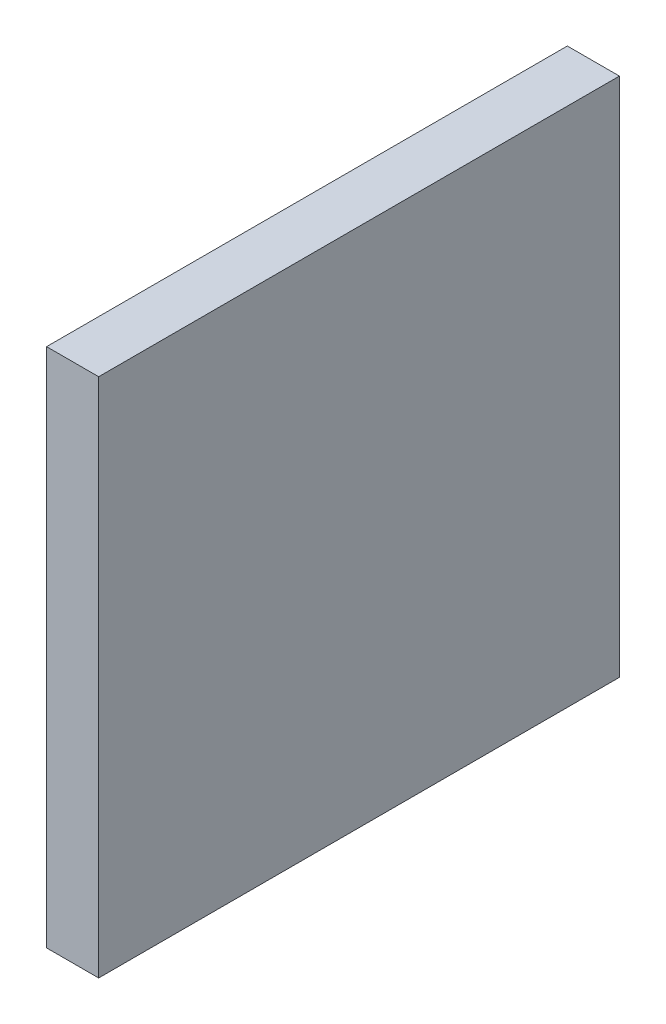
ISO-10303-21;
HEADER;
FILE_DESCRIPTION(('STEP AP214'),'2;1');
FILE_NAME('part.step','',(''),(''),'','','');
FILE_SCHEMA(('AUTOMOTIVE_DESIGN { 1 0 10303 214 1 1 1 1 }'));
ENDSEC;
DATA;
#1=APPLICATION_CONTEXT('core data for automotive mechanical design processes');
#2=APPLICATION_PROTOCOL_DEFINITION('international standard','automotive_design',2000,#1);
#3=PRODUCT_CONTEXT('',#1,'mechanical');
#4=PRODUCT('Part','Part','',(#3));
#5=PRODUCT_RELATED_PRODUCT_CATEGORY('part','',(#4));
#6=PRODUCT_DEFINITION_FORMATION('','',#4);
#7=PRODUCT_DEFINITION_CONTEXT('part definition',#1,'design');
#8=PRODUCT_DEFINITION('design','',#6,#7);
#9=PRODUCT_DEFINITION_SHAPE('','',#8);
#10=(LENGTH_UNIT() NAMED_UNIT(*) SI_UNIT(.MILLI.,.METRE.));
#11=(NAMED_UNIT(*) PLANE_ANGLE_UNIT() SI_UNIT($,.RADIAN.));
#12=(NAMED_UNIT(*) SI_UNIT($,.STERADIAN.) SOLID_ANGLE_UNIT());
#13=UNCERTAINTY_MEASURE_WITH_UNIT(LENGTH_MEASURE(1.E-05),#10,'distance_accuracy_value','');
#14=(GEOMETRIC_REPRESENTATION_CONTEXT(3) GLOBAL_UNCERTAINTY_ASSIGNED_CONTEXT((#13)) GLOBAL_UNIT_ASSIGNED_CONTEXT((#10,
#11,#12)) REPRESENTATION_CONTEXT('',''));
#15=CARTESIAN_POINT('',(0.,0.,0.));
#16=DIRECTION('',(0.,0.,1.));
#17=DIRECTION('',(1.,0.,0.));
#18=AXIS2_PLACEMENT_3D('',#15,#16,#17);
#19=CARTESIAN_POINT('',(-8.,0.,0.));
#20=DIRECTION('',(-1.,0.,0.));
#21=DIRECTION('',(0.,0.,1.));
#22=AXIS2_PLACEMENT_3D('',#19,#20,#21);
#23=PLANE('',#22);
#24=DIRECTION('',(0.,1.,0.));
#25=VECTOR('',#24,1.);
#26=CARTESIAN_POINT('',(-8.,-497.839817094446,-491.311498588477));
#27=LINE('',#26,#25);
#28=CARTESIAN_POINT('',(-8.,-487.839817094446,-491.311498588477));
#29=VERTEX_POINT('',#28);
#30=CARTESIAN_POINT('',(-8.,-382.099817094446,-491.311498588477));
#31=VERTEX_POINT('',#30);
#32=EDGE_CURVE('E189',#29,#31,#27,.T.);
#33=ORIENTED_EDGE('',*,*,#32,.T.);
#34=CARTESIAN_POINT('',(-8.,-382.099817094446,-501.311498588477));
#35=DIRECTION('',(-1.,0.,0.));
#36=DIRECTION('',(0.,0.,1.));
#37=AXIS2_PLACEMENT_3D('',#34,#35,#36);
#38=CIRCLE('',#37,10.);
#39=CARTESIAN_POINT('',(-8.,-372.099817094446,-501.311498588477));
#40=VERTEX_POINT('',#39);
#41=EDGE_CURVE('E276',#31,#40,#38,.T.);
#42=ORIENTED_EDGE('',*,*,#41,.T.);
#43=DIRECTION('',(0.,0.,1.));
#44=VECTOR('',#43,1.);
#45=CARTESIAN_POINT('',(-8.,-372.099817094446,-637.051498588477));
#46=LINE('',#45,#44);
#47=CARTESIAN_POINT('',(-8.,-372.099817094446,-627.051498588477));
#48=VERTEX_POINT('',#47);
#49=EDGE_CURVE('E296',#48,#40,#46,.T.);
#50=ORIENTED_EDGE('',*,*,#49,.F.);
#51=CARTESIAN_POINT('',(-8.,-382.099817094446,-627.051498588477));
#52=DIRECTION('',(-1.,0.,0.));
#53=DIRECTION('',(0.,0.,1.));
#54=AXIS2_PLACEMENT_3D('',#51,#52,#53);
#55=CIRCLE('',#54,10.);
#56=CARTESIAN_POINT('',(-8.,-382.099817094446,-637.051498588477));
#57=VERTEX_POINT('',#56);
#58=EDGE_CURVE('E274',#48,#57,#55,.T.);
#59=ORIENTED_EDGE('',*,*,#58,.T.);
#60=DIRECTION('',(0.,1.,0.));
#61=VECTOR('',#60,1.);
#62=CARTESIAN_POINT('',(-8.,-497.839817094446,-637.051498588477));
#63=LINE('',#62,#61);
#64=CARTESIAN_POINT('',(-8.,-487.839817094446,-637.051498588477));
#65=VERTEX_POINT('',#64);
#66=EDGE_CURVE('E196',#65,#57,#63,.T.);
#67=ORIENTED_EDGE('',*,*,#66,.F.);
#68=CARTESIAN_POINT('',(-8.,-487.839817094446,-627.051498588477));
#69=DIRECTION('',(-1.,0.,0.));
#70=DIRECTION('',(0.,0.,1.));
#71=AXIS2_PLACEMENT_3D('',#68,#69,#70);
#72=CIRCLE('',#71,10.);
#73=CARTESIAN_POINT('',(-8.,-497.839817094446,-627.051498588477));
#74=VERTEX_POINT('',#73);
#75=EDGE_CURVE('E240',#65,#74,#72,.T.);
#76=ORIENTED_EDGE('',*,*,#75,.T.);
#77=DIRECTION('',(0.,0.,1.));
#78=VECTOR('',#77,1.);
#79=CARTESIAN_POINT('',(-8.,-497.839817094446,-637.051498588477));
#80=LINE('',#79,#78);
#81=CARTESIAN_POINT('',(-8.,-497.839817094446,-501.311498588477));
#82=VERTEX_POINT('',#81);
#83=EDGE_CURVE('E192',#74,#82,#80,.T.);
#84=ORIENTED_EDGE('',*,*,#83,.T.);
#85=CARTESIAN_POINT('',(-8.,-487.839817094446,-501.311498588477));
#86=DIRECTION('',(-1.,0.,0.));
#87=DIRECTION('',(0.,0.,1.));
#88=AXIS2_PLACEMENT_3D('',#85,#86,#87);
#89=CIRCLE('',#88,10.);
#90=EDGE_CURVE('E242',#82,#29,#89,.T.);
#91=ORIENTED_EDGE('',*,*,#90,.T.);
#92=EDGE_LOOP('',(#33,#42,#50,#59,#67,#76,#84,#91));
#93=FACE_BOUND('',#92,.T.);
#94=DIRECTION('',(0.,1.,0.));
#95=VECTOR('',#94,1.);
#96=CARTESIAN_POINT('',(-8.,-486.840789535951,-611.792471029982));
#97=LINE('',#96,#95);
#98=CARTESIAN_POINT('',(-8.,-486.840789535951,-611.792471029982));
#99=VERTEX_POINT('',#98);
#100=CARTESIAN_POINT('',(-8.,-387.358844652941,-611.792471029982));
#101=VERTEX_POINT('',#100);
#102=EDGE_CURVE('E158',#99,#101,#97,.T.);
#103=ORIENTED_EDGE('',*,*,#102,.T.);
#104=DIRECTION('',(0.,0.,1.));
#105=VECTOR('',#104,1.);
#106=CARTESIAN_POINT('',(-8.,-387.358844652941,-611.792471029982));
#107=LINE('',#106,#105);
#108=CARTESIAN_POINT('',(-8.,-387.358844652941,-517.310526146972));
#109=VERTEX_POINT('',#108);
#110=EDGE_CURVE('E185',#101,#109,#107,.T.);
#111=ORIENTED_EDGE('',*,*,#110,.T.);
#112=CARTESIAN_POINT('',(-8.,-392.358844652941,-517.310526146972));
#113=DIRECTION('',(-1.,0.,0.));
#114=DIRECTION('',(0.,0.,1.));
#115=AXIS2_PLACEMENT_3D('',#112,#113,#114);
#116=CIRCLE('',#115,5.);
#117=CARTESIAN_POINT('',(-8.,-392.358844652941,-512.310526146972));
#118=VERTEX_POINT('',#117);
#119=EDGE_CURVE('E268',#109,#118,#116,.F.);
#120=ORIENTED_EDGE('',*,*,#119,.T.);
#121=DIRECTION('',(0.,1.,0.));
#122=VECTOR('',#121,1.);
#123=CARTESIAN_POINT('',(-8.,-486.840789535951,-512.310526146972));
#124=LINE('',#123,#122);
#125=CARTESIAN_POINT('',(-8.,-481.840789535951,-512.310526146972));
#126=VERTEX_POINT('',#125);
#127=EDGE_CURVE('E182',#126,#118,#124,.T.);
#128=ORIENTED_EDGE('',*,*,#127,.F.);
#129=CARTESIAN_POINT('',(-8.,-481.840789535951,-517.310526146972));
#130=DIRECTION('',(-1.,0.,0.));
#131=DIRECTION('',(0.,0.,1.));
#132=AXIS2_PLACEMENT_3D('',#129,#130,#131);
#133=CIRCLE('',#132,5.);
#134=CARTESIAN_POINT('',(-8.,-486.840789535951,-517.310526146972));
#135=VERTEX_POINT('',#134);
#136=EDGE_CURVE('E181',#126,#135,#133,.F.);
#137=ORIENTED_EDGE('',*,*,#136,.T.);
#138=DIRECTION('',(0.,0.,1.));
#139=VECTOR('',#138,1.);
#140=CARTESIAN_POINT('',(-8.,-486.840789535951,-611.792471029982));
#141=LINE('',#140,#139);
#142=EDGE_CURVE('E171',#99,#135,#141,.T.);
#143=ORIENTED_EDGE('',*,*,#142,.F.);
#144=EDGE_LOOP('',(#103,#111,#120,#128,#137,#143));
#145=FACE_BOUND('',#144,.T.);
#146=ADVANCED_FACE('F38',(#93,#145),#23,.T.);
#147=CARTESIAN_POINT('',(100.,-1000.,-1.22464679914735E-13));
#148=DIRECTION('',(0.,1.,0.));
#149=DIRECTION('',(0.,0.,1.));
#150=AXIS2_PLACEMENT_3D('',#147,#148,#149);
#151=PLANE('',#150);
#152=DIRECTION('',(0.,0.,-1.));
#153=VECTOR('',#152,1.);
#154=CARTESIAN_POINT('',(0.,-1000.,-1.22464679914735E-13));
#155=LINE('',#154,#153);
#156=CARTESIAN_POINT('',(0.,-1000.,-1.22464679914735E-13));
#157=VERTEX_POINT('',#156);
#158=CARTESIAN_POINT('',(0.,-1000.,-1000.));
#159=VERTEX_POINT('',#158);
#160=EDGE_CURVE('E199',#157,#159,#155,.T.);
#161=ORIENTED_EDGE('',*,*,#160,.T.);
#162=DIRECTION('',(-1.,0.,0.));
#163=VECTOR('',#162,1.);
#164=CARTESIAN_POINT('',(100.,-1000.,-1000.));
#165=LINE('',#164,#163);
#166=CARTESIAN_POINT('',(100.,-1000.,-1000.));
#167=VERTEX_POINT('',#166);
#168=EDGE_CURVE('E235',#167,#159,#165,.T.);
#169=ORIENTED_EDGE('',*,*,#168,.F.);
#170=DIRECTION('',(0.,0.,-1.));
#171=VECTOR('',#170,1.);
#172=CARTESIAN_POINT('',(100.,-1000.,-1.22464679914735E-13));
#173=LINE('',#172,#171);
#174=CARTESIAN_POINT('',(100.,-1000.,-1.22464679914735E-13));
#175=VERTEX_POINT('',#174);
#176=EDGE_CURVE('E208',#175,#167,#173,.T.);
#177=ORIENTED_EDGE('',*,*,#176,.F.);
#178=DIRECTION('',(-1.,0.,0.));
#179=VECTOR('',#178,1.);
#180=CARTESIAN_POINT('',(100.,-1000.,-1.22464679914735E-13));
#181=LINE('',#180,#179);
#182=EDGE_CURVE('E219',#175,#157,#181,.T.);
#183=ORIENTED_EDGE('',*,*,#182,.T.);
#184=EDGE_LOOP('',(#161,#169,#177,#183));
#185=FACE_BOUND('',#184,.T.);
#186=ADVANCED_FACE('F325',(#185),#151,.F.);
#187=CARTESIAN_POINT('',(100.,0.,-1000.));
#188=DIRECTION('',(0.,0.,-1.));
#189=DIRECTION('',(0.,1.,0.));
#190=AXIS2_PLACEMENT_3D('',#187,#188,#189);
#191=PLANE('',#190);
#192=DIRECTION('',(0.,-1.,0.));
#193=VECTOR('',#192,1.);
#194=CARTESIAN_POINT('',(0.,0.,-1000.));
#195=LINE('',#194,#193);
#196=CARTESIAN_POINT('',(0.,0.,-1000.));
#197=VERTEX_POINT('',#196);
#198=EDGE_CURVE('E222',#197,#159,#195,.T.);
#199=ORIENTED_EDGE('',*,*,#198,.F.);
#200=DIRECTION('',(-1.,0.,0.));
#201=VECTOR('',#200,1.);
#202=CARTESIAN_POINT('',(100.,0.,-1000.));
#203=LINE('',#202,#201);
#204=CARTESIAN_POINT('',(100.,0.,-1000.));
#205=VERTEX_POINT('',#204);
#206=EDGE_CURVE('E233',#205,#197,#203,.T.);
#207=ORIENTED_EDGE('',*,*,#206,.F.);
#208=DIRECTION('',(0.,-1.,0.));
#209=VECTOR('',#208,1.);
#210=CARTESIAN_POINT('',(100.,0.,-1000.));
#211=LINE('',#210,#209);
#212=EDGE_CURVE('E210',#205,#167,#211,.T.);
#213=ORIENTED_EDGE('',*,*,#212,.T.);
#214=ORIENTED_EDGE('',*,*,#168,.T.);
#215=EDGE_LOOP('',(#199,#207,#213,#214));
#216=FACE_BOUND('',#215,.T.);
#217=ADVANCED_FACE('F330',(#216),#191,.T.);
#218=CARTESIAN_POINT('',(100.,0.,0.));
#219=DIRECTION('',(0.,1.,0.));
#220=DIRECTION('',(0.,0.,1.));
#221=AXIS2_PLACEMENT_3D('',#218,#219,#220);
#222=PLANE('',#221);
#223=DIRECTION('',(0.,0.,-1.));
#224=VECTOR('',#223,1.);
#225=CARTESIAN_POINT('',(0.,0.,0.));
#226=LINE('',#225,#224);
#227=CARTESIAN_POINT('',(0.,0.,0.));
#228=VERTEX_POINT('',#227);
#229=EDGE_CURVE('E225',#228,#197,#226,.T.);
#230=ORIENTED_EDGE('',*,*,#229,.F.);
#231=DIRECTION('',(-1.,0.,0.));
#232=VECTOR('',#231,1.);
#233=CARTESIAN_POINT('',(100.,0.,0.));
#234=LINE('',#233,#232);
#235=CARTESIAN_POINT('',(100.,0.,0.));
#236=VERTEX_POINT('',#235);
#237=EDGE_CURVE('E231',#236,#228,#234,.T.);
#238=ORIENTED_EDGE('',*,*,#237,.F.);
#239=DIRECTION('',(0.,0.,-1.));
#240=VECTOR('',#239,1.);
#241=CARTESIAN_POINT('',(100.,0.,0.));
#242=LINE('',#241,#240);
#243=EDGE_CURVE('E214',#236,#205,#242,.T.);
#244=ORIENTED_EDGE('',*,*,#243,.T.);
#245=ORIENTED_EDGE('',*,*,#206,.T.);
#246=EDGE_LOOP('',(#230,#238,#244,#245));
#247=FACE_BOUND('',#246,.T.);
#248=ADVANCED_FACE('F356',(#247),#222,.T.);
#249=CARTESIAN_POINT('',(100.,0.,0.));
#250=DIRECTION('',(0.,0.,-1.));
#251=DIRECTION('',(0.,1.,0.));
#252=AXIS2_PLACEMENT_3D('',#249,#250,#251);
#253=PLANE('',#252);
#254=DIRECTION('',(0.,-1.,0.));
#255=VECTOR('',#254,1.);
#256=CARTESIAN_POINT('',(0.,0.,0.));
#257=LINE('',#256,#255);
#258=EDGE_CURVE('E211',#228,#157,#257,.T.);
#259=ORIENTED_EDGE('',*,*,#258,.T.);
#260=ORIENTED_EDGE('',*,*,#182,.F.);
#261=DIRECTION('',(0.,-1.,0.));
#262=VECTOR('',#261,1.);
#263=CARTESIAN_POINT('',(100.,0.,0.));
#264=LINE('',#263,#262);
#265=EDGE_CURVE('E217',#236,#175,#264,.T.);
#266=ORIENTED_EDGE('',*,*,#265,.F.);
#267=ORIENTED_EDGE('',*,*,#237,.T.);
#268=EDGE_LOOP('',(#259,#260,#266,#267));
#269=FACE_BOUND('',#268,.T.);
#270=ADVANCED_FACE('F350',(#269),#253,.F.);
#271=CARTESIAN_POINT('',(100.,0.,0.));
#272=DIRECTION('',(-1.,0.,0.));
#273=DIRECTION('',(0.,0.,1.));
#274=AXIS2_PLACEMENT_3D('',#271,#272,#273);
#275=PLANE('',#274);
#276=ORIENTED_EDGE('',*,*,#176,.T.);
#277=ORIENTED_EDGE('',*,*,#212,.F.);
#278=ORIENTED_EDGE('',*,*,#243,.F.);
#279=ORIENTED_EDGE('',*,*,#265,.T.);
#280=EDGE_LOOP('',(#276,#277,#278,#279));
#281=FACE_BOUND('',#280,.T.);
#282=ADVANCED_FACE('F347',(#281),#275,.F.);
#283=CARTESIAN_POINT('',(0.,0.,0.));
#284=DIRECTION('',(-1.,0.,0.));
#285=DIRECTION('',(0.,0.,1.));
#286=AXIS2_PLACEMENT_3D('',#283,#284,#285);
#287=PLANE('',#286);
#288=DIRECTION('',(0.,1.,0.));
#289=VECTOR('',#288,1.);
#290=CARTESIAN_POINT('',(0.,-497.839817094446,-637.051498588477));
#291=LINE('',#290,#289);
#292=CARTESIAN_POINT('',(0.,-487.839817094446,-637.051498588477));
#293=VERTEX_POINT('',#292);
#294=CARTESIAN_POINT('',(0.,-382.099817094446,-637.051498588477));
#295=VERTEX_POINT('',#294);
#296=EDGE_CURVE('E193',#293,#295,#291,.T.);
#297=ORIENTED_EDGE('',*,*,#296,.T.);
#298=CARTESIAN_POINT('',(0.,-382.099817094446,-627.051498588477));
#299=DIRECTION('',(-1.,0.,0.));
#300=DIRECTION('',(0.,0.,1.));
#301=AXIS2_PLACEMENT_3D('',#298,#299,#300);
#302=CIRCLE('',#301,10.);
#303=CARTESIAN_POINT('',(0.,-372.099817094446,-627.051498588477));
#304=VERTEX_POINT('',#303);
#305=EDGE_CURVE('E11',#295,#304,#302,.F.);
#306=ORIENTED_EDGE('',*,*,#305,.T.);
#307=DIRECTION('',(0.,0.,1.));
#308=VECTOR('',#307,1.);
#309=CARTESIAN_POINT('',(0.,-372.099817094446,-637.051498588477));
#310=LINE('',#309,#308);
#311=CARTESIAN_POINT('',(0.,-372.099817094446,-501.311498588477));
#312=VERTEX_POINT('',#311);
#313=EDGE_CURVE('E178',#304,#312,#310,.T.);
#314=ORIENTED_EDGE('',*,*,#313,.T.);
#315=CARTESIAN_POINT('',(0.,-382.099817094446,-501.311498588477));
#316=DIRECTION('',(-1.,0.,0.));
#317=DIRECTION('',(0.,0.,1.));
#318=AXIS2_PLACEMENT_3D('',#315,#316,#317);
#319=CIRCLE('',#318,10.);
#320=CARTESIAN_POINT('',(0.,-382.099817094446,-491.311498588477));
#321=VERTEX_POINT('',#320);
#322=EDGE_CURVE('E46',#312,#321,#319,.F.);
#323=ORIENTED_EDGE('',*,*,#322,.T.);
#324=DIRECTION('',(0.,1.,0.));
#325=VECTOR('',#324,1.);
#326=CARTESIAN_POINT('',(0.,-497.839817094446,-491.311498588477));
#327=LINE('',#326,#325);
#328=CARTESIAN_POINT('',(0.,-487.839817094446,-491.311498588477));
#329=VERTEX_POINT('',#328);
#330=EDGE_CURVE('E200',#329,#321,#327,.T.);
#331=ORIENTED_EDGE('',*,*,#330,.F.);
#332=CARTESIAN_POINT('',(0.,-487.839817094446,-501.311498588477));
#333=DIRECTION('',(-1.,0.,0.));
#334=DIRECTION('',(0.,0.,1.));
#335=AXIS2_PLACEMENT_3D('',#332,#333,#334);
#336=CIRCLE('',#335,10.);
#337=CARTESIAN_POINT('',(0.,-497.839817094446,-501.311498588477));
#338=VERTEX_POINT('',#337);
#339=EDGE_CURVE('E251',#329,#338,#336,.F.);
#340=ORIENTED_EDGE('',*,*,#339,.T.);
#341=DIRECTION('',(0.,0.,1.));
#342=VECTOR('',#341,1.);
#343=CARTESIAN_POINT('',(0.,-497.839817094446,-637.051498588477));
#344=LINE('',#343,#342);
#345=CARTESIAN_POINT('',(0.,-497.839817094446,-627.051498588477));
#346=VERTEX_POINT('',#345);
#347=EDGE_CURVE('E203',#346,#338,#344,.T.);
#348=ORIENTED_EDGE('',*,*,#347,.F.);
#349=CARTESIAN_POINT('',(0.,-487.839817094446,-627.051498588477));
#350=DIRECTION('',(-1.,0.,0.));
#351=DIRECTION('',(0.,0.,1.));
#352=AXIS2_PLACEMENT_3D('',#349,#350,#351);
#353=CIRCLE('',#352,10.);
#354=EDGE_CURVE('E253',#346,#293,#353,.F.);
#355=ORIENTED_EDGE('',*,*,#354,.T.);
#356=EDGE_LOOP('',(#297,#306,#314,#323,#331,#340,#348,#355));
#357=FACE_BOUND('',#356,.T.);
#358=ORIENTED_EDGE('',*,*,#160,.F.);
#359=ORIENTED_EDGE('',*,*,#258,.F.);
#360=ORIENTED_EDGE('',*,*,#229,.T.);
#361=ORIENTED_EDGE('',*,*,#198,.T.);
#362=EDGE_LOOP('',(#358,#359,#360,#361));
#363=FACE_BOUND('',#362,.T.);
#364=ADVANCED_FACE('F285',(#357,#363),#287,.T.);
#365=CARTESIAN_POINT('',(-8.,-497.839817094446,-637.051498588477));
#366=DIRECTION('',(0.,0.,-1.));
#367=DIRECTION('',(-1.,0.,0.));
#368=AXIS2_PLACEMENT_3D('',#365,#366,#367);
#369=PLANE('',#368);
#370=ORIENTED_EDGE('',*,*,#66,.T.);
#371=DIRECTION('',(1.,0.,0.));
#372=VECTOR('',#371,1.);
#373=CARTESIAN_POINT('',(0.,-382.099817094446,-637.051498588477));
#374=LINE('',#373,#372);
#375=EDGE_CURVE('E281',#57,#295,#374,.T.);
#376=ORIENTED_EDGE('',*,*,#375,.T.);
#377=ORIENTED_EDGE('',*,*,#296,.F.);
#378=DIRECTION('',(1.,0.,0.));
#379=VECTOR('',#378,1.);
#380=CARTESIAN_POINT('',(-8.,-487.839817094446,-637.051498588477));
#381=LINE('',#380,#379);
#382=EDGE_CURVE('E249',#293,#65,#381,.F.);
#383=ORIENTED_EDGE('',*,*,#382,.T.);
#384=EDGE_LOOP('',(#370,#376,#377,#383));
#385=FACE_BOUND('',#384,.T.);
#386=ADVANCED_FACE('F336',(#385),#369,.T.);
#387=CARTESIAN_POINT('',(-8.,-497.839817094446,-637.051498588477));
#388=DIRECTION('',(0.,1.,0.));
#389=DIRECTION('',(0.,0.,1.));
#390=AXIS2_PLACEMENT_3D('',#387,#388,#389);
#391=PLANE('',#390);
#392=ORIENTED_EDGE('',*,*,#347,.T.);
#393=DIRECTION('',(1.,0.,0.));
#394=VECTOR('',#393,1.);
#395=CARTESIAN_POINT('',(-8.,-497.839817094446,-501.311498588477));
#396=LINE('',#395,#394);
#397=EDGE_CURVE('E247',#338,#82,#396,.F.);
#398=ORIENTED_EDGE('',*,*,#397,.T.);
#399=ORIENTED_EDGE('',*,*,#83,.F.);
#400=DIRECTION('',(1.,0.,0.));
#401=VECTOR('',#400,1.);
#402=CARTESIAN_POINT('',(0.,-497.839817094446,-627.051498588477));
#403=LINE('',#402,#401);
#404=EDGE_CURVE('E244',#74,#346,#403,.T.);
#405=ORIENTED_EDGE('',*,*,#404,.T.);
#406=EDGE_LOOP('',(#392,#398,#399,#405));
#407=FACE_BOUND('',#406,.T.);
#408=ADVANCED_FACE('F339',(#407),#391,.F.);
#409=CARTESIAN_POINT('',(-8.,-497.839817094446,-491.311498588477));
#410=DIRECTION('',(0.,0.,-1.));
#411=DIRECTION('',(-1.,0.,0.));
#412=AXIS2_PLACEMENT_3D('',#409,#410,#411);
#413=PLANE('',#412);
#414=ORIENTED_EDGE('',*,*,#330,.T.);
#415=DIRECTION('',(-1.,0.,0.));
#416=VECTOR('',#415,1.);
#417=CARTESIAN_POINT('',(-8.,-382.099817094446,-491.311498588477));
#418=LINE('',#417,#416);
#419=EDGE_CURVE('E271',#321,#31,#418,.T.);
#420=ORIENTED_EDGE('',*,*,#419,.T.);
#421=ORIENTED_EDGE('',*,*,#32,.F.);
#422=DIRECTION('',(1.,0.,0.));
#423=VECTOR('',#422,1.);
#424=CARTESIAN_POINT('',(-8.,-487.839817094446,-491.311498588477));
#425=LINE('',#424,#423);
#426=EDGE_CURVE('E237',#29,#329,#425,.T.);
#427=ORIENTED_EDGE('',*,*,#426,.T.);
#428=EDGE_LOOP('',(#414,#420,#421,#427));
#429=FACE_BOUND('',#428,.T.);
#430=ADVANCED_FACE('F290',(#429),#413,.F.);
#431=CARTESIAN_POINT('',(-8.,-487.839817094446,-501.311498588477));
#432=DIRECTION('',(1.,0.,0.));
#433=DIRECTION('',(0.,0.,-1.));
#434=AXIS2_PLACEMENT_3D('',#431,#432,#433);
#435=CYLINDRICAL_SURFACE('',#434,10.);
#436=ORIENTED_EDGE('',*,*,#90,.F.);
#437=ORIENTED_EDGE('',*,*,#397,.F.);
#438=ORIENTED_EDGE('',*,*,#339,.F.);
#439=ORIENTED_EDGE('',*,*,#426,.F.);
#440=EDGE_LOOP('',(#436,#437,#438,#439));
#441=FACE_BOUND('',#440,.T.);
#442=ADVANCED_FACE('F346',(#441),#435,.T.);
#443=CARTESIAN_POINT('',(-8.,-487.839817094446,-627.051498588477));
#444=DIRECTION('',(-1.,0.,0.));
#445=DIRECTION('',(0.,0.,1.));
#446=AXIS2_PLACEMENT_3D('',#443,#444,#445);
#447=CYLINDRICAL_SURFACE('',#446,10.);
#448=ORIENTED_EDGE('',*,*,#75,.F.);
#449=ORIENTED_EDGE('',*,*,#382,.F.);
#450=ORIENTED_EDGE('',*,*,#354,.F.);
#451=ORIENTED_EDGE('',*,*,#404,.F.);
#452=EDGE_LOOP('',(#448,#449,#450,#451));
#453=FACE_BOUND('',#452,.T.);
#454=ADVANCED_FACE('F366',(#453),#447,.T.);
#455=CARTESIAN_POINT('',(-18.,-387.358844652941,-611.792471029982));
#456=DIRECTION('',(0.,1.,0.));
#457=DIRECTION('',(0.,0.,1.));
#458=AXIS2_PLACEMENT_3D('',#455,#456,#457);
#459=PLANE('',#458);
#460=DIRECTION('',(0.100016717402608,0.,-0.994985756802582));
#461=VECTOR('',#460,1.);
#462=CARTESIAN_POINT('',(-8.10003343759993,-387.358844652941,-610.797318937404));
#463=LINE('',#462,#461);
#464=CARTESIAN_POINT('',(-17.4973962354797,-387.358844652941,-517.310526146972));
#465=VERTEX_POINT('',#464);
#466=EDGE_CURVE('E165',#465,#101,#463,.T.);
#467=ORIENTED_EDGE('',*,*,#466,.F.);
#468=DIRECTION('',(1.,0.,0.));
#469=VECTOR('',#468,1.);
#470=CARTESIAN_POINT('',(-8.,-387.358844652941,-517.310526146972));
#471=LINE('',#470,#469);
#472=EDGE_CURVE('E255',#465,#109,#471,.T.);
#473=ORIENTED_EDGE('',*,*,#472,.T.);
#474=ORIENTED_EDGE('',*,*,#110,.F.);
#475=EDGE_LOOP('',(#467,#473,#474));
#476=FACE_BOUND('',#475,.T.);
#477=ADVANCED_FACE('F304',(#476),#459,.T.);
#478=CARTESIAN_POINT('',(-18.,-486.840789535951,-611.792471029982));
#479=DIRECTION('',(0.,1.,0.));
#480=DIRECTION('',(0.,0.,1.));
#481=AXIS2_PLACEMENT_3D('',#478,#479,#480);
#482=PLANE('',#481);
#483=ORIENTED_EDGE('',*,*,#142,.T.);
#484=DIRECTION('',(1.,0.,0.));
#485=VECTOR('',#484,1.);
#486=CARTESIAN_POINT('',(-18.,-486.840789535951,-517.310526146972));
#487=LINE('',#486,#485);
#488=CARTESIAN_POINT('',(-17.4973962354797,-486.840789535951,-517.310526146972));
#489=VERTEX_POINT('',#488);
#490=EDGE_CURVE('E177',#135,#489,#487,.F.);
#491=ORIENTED_EDGE('',*,*,#490,.T.);
#492=DIRECTION('',(-0.100016717402608,0.,0.994985756802582));
#493=VECTOR('',#492,1.);
#494=CARTESIAN_POINT('',(-8.,-486.840789535951,-611.792471029982));
#495=LINE('',#494,#493);
#496=EDGE_CURVE('E162',#99,#489,#495,.T.);
#497=ORIENTED_EDGE('',*,*,#496,.F.);
#498=EDGE_LOOP('',(#483,#491,#497));
#499=FACE_BOUND('',#498,.T.);
#500=ADVANCED_FACE('F175',(#499),#482,.F.);
#501=CARTESIAN_POINT('',(-18.,-486.840789535951,-512.310526146972));
#502=DIRECTION('',(0.,0.,-1.));
#503=DIRECTION('',(-1.,0.,0.));
#504=AXIS2_PLACEMENT_3D('',#501,#502,#503);
#505=PLANE('',#504);
#506=ORIENTED_EDGE('',*,*,#127,.T.);
#507=DIRECTION('',(1.,0.,0.));
#508=VECTOR('',#507,1.);
#509=CARTESIAN_POINT('',(-18.,-392.358844652941,-512.310526146972));
#510=LINE('',#509,#508);
#511=CARTESIAN_POINT('',(-18.,-392.358844652941,-512.310526146972));
#512=VERTEX_POINT('',#511);
#513=EDGE_CURVE('E261',#118,#512,#510,.F.);
#514=ORIENTED_EDGE('',*,*,#513,.T.);
#515=DIRECTION('',(0.,1.,0.));
#516=VECTOR('',#515,1.);
#517=CARTESIAN_POINT('',(-18.,-486.840789535951,-512.310526146972));
#518=LINE('',#517,#516);
#519=CARTESIAN_POINT('',(-18.,-481.840789535951,-512.310526146972));
#520=VERTEX_POINT('',#519);
#521=EDGE_CURVE('E170',#520,#512,#518,.T.);
#522=ORIENTED_EDGE('',*,*,#521,.F.);
#523=DIRECTION('',(1.,0.,0.));
#524=VECTOR('',#523,1.);
#525=CARTESIAN_POINT('',(-18.,-481.840789535951,-512.310526146972));
#526=LINE('',#525,#524);
#527=EDGE_CURVE('E258',#520,#126,#526,.T.);
#528=ORIENTED_EDGE('',*,*,#527,.T.);
#529=EDGE_LOOP('',(#506,#514,#522,#528));
#530=FACE_BOUND('',#529,.T.);
#531=ADVANCED_FACE('F312',(#530),#505,.F.);
#532=CARTESIAN_POINT('',(-8.,-287.840789535951,-611.792471029982));
#533=DIRECTION('',(0.994985756802582,0.,0.100016717402608));
#534=DIRECTION('',(0.100016717402608,0.,-0.994985756802582));
#535=AXIS2_PLACEMENT_3D('',#532,#533,#534);
#536=PLANE('',#535);
#537=ORIENTED_EDGE('',*,*,#521,.T.);
#538=CARTESIAN_POINT('',(-17.4973962354797,-392.358844652941,-517.310526146972));
#539=DIRECTION('',(0.994985756802582,0.,0.100016717402608));
#540=DIRECTION('',(-0.100016717402608,0.,0.994985756802582));
#541=AXIS2_PLACEMENT_3D('',#538,#539,#540);
#542=ELLIPSE('',#541,5.02519756269442,5.);
#543=EDGE_CURVE('E265',#512,#465,#542,.F.);
#544=ORIENTED_EDGE('',*,*,#543,.T.);
#545=ORIENTED_EDGE('',*,*,#466,.T.);
#546=ORIENTED_EDGE('',*,*,#102,.F.);
#547=ORIENTED_EDGE('',*,*,#496,.T.);
#548=CARTESIAN_POINT('',(-17.4973962354797,-481.840789535951,-517.310526146972));
#549=DIRECTION('',(0.994985756802582,0.,0.100016717402608));
#550=DIRECTION('',(0.100016717402608,0.,-0.994985756802582));
#551=AXIS2_PLACEMENT_3D('',#548,#549,#550);
#552=ELLIPSE('',#551,5.02519756269442,5.);
#553=EDGE_CURVE('E263',#489,#520,#552,.F.);
#554=ORIENTED_EDGE('',*,*,#553,.T.);
#555=EDGE_LOOP('',(#537,#544,#545,#546,#547,#554));
#556=FACE_BOUND('',#555,.T.);
#557=ADVANCED_FACE('F161',(#556),#536,.F.);
#558=CARTESIAN_POINT('',(-18.,-392.358844652941,-517.310526146972));
#559=DIRECTION('',(-1.,0.,0.));
#560=DIRECTION('',(0.,0.,1.));
#561=AXIS2_PLACEMENT_3D('',#558,#559,#560);
#562=CYLINDRICAL_SURFACE('',#561,5.);
#563=ORIENTED_EDGE('',*,*,#543,.F.);
#564=ORIENTED_EDGE('',*,*,#513,.F.);
#565=ORIENTED_EDGE('',*,*,#119,.F.);
#566=ORIENTED_EDGE('',*,*,#472,.F.);
#567=EDGE_LOOP('',(#563,#564,#565,#566));
#568=FACE_BOUND('',#567,.T.);
#569=ADVANCED_FACE('F308',(#568),#562,.T.);
#570=CARTESIAN_POINT('',(-18.,-481.840789535951,-517.310526146972));
#571=DIRECTION('',(1.,0.,0.));
#572=DIRECTION('',(0.,0.,-1.));
#573=AXIS2_PLACEMENT_3D('',#570,#571,#572);
#574=CYLINDRICAL_SURFACE('',#573,5.);
#575=ORIENTED_EDGE('',*,*,#553,.F.);
#576=ORIENTED_EDGE('',*,*,#490,.F.);
#577=ORIENTED_EDGE('',*,*,#136,.F.);
#578=ORIENTED_EDGE('',*,*,#527,.F.);
#579=EDGE_LOOP('',(#575,#576,#577,#578));
#580=FACE_BOUND('',#579,.T.);
#581=ADVANCED_FACE('F315',(#580),#574,.T.);
#582=CARTESIAN_POINT('',(0.,-372.099817094446,-637.051498588477));
#583=DIRECTION('',(0.,-1.,0.));
#584=DIRECTION('',(0.,0.,-1.));
#585=AXIS2_PLACEMENT_3D('',#582,#583,#584);
#586=PLANE('',#585);
#587=ORIENTED_EDGE('',*,*,#49,.T.);
#588=DIRECTION('',(-1.,0.,0.));
#589=VECTOR('',#588,1.);
#590=CARTESIAN_POINT('',(0.,-372.099817094446,-501.311498588477));
#591=LINE('',#590,#589);
#592=EDGE_CURVE('E59',#40,#312,#591,.F.);
#593=ORIENTED_EDGE('',*,*,#592,.T.);
#594=ORIENTED_EDGE('',*,*,#313,.F.);
#595=DIRECTION('',(1.,0.,0.));
#596=VECTOR('',#595,1.);
#597=CARTESIAN_POINT('',(-8.,-372.099817094446,-627.051498588477));
#598=LINE('',#597,#596);
#599=EDGE_CURVE('E278',#304,#48,#598,.F.);
#600=ORIENTED_EDGE('',*,*,#599,.T.);
#601=EDGE_LOOP('',(#587,#593,#594,#600));
#602=FACE_BOUND('',#601,.T.);
#603=ADVANCED_FACE('F298',(#602),#586,.F.);
#604=CARTESIAN_POINT('',(-8.,-382.099817094446,-501.311498588477));
#605=DIRECTION('',(-1.,0.,0.));
#606=DIRECTION('',(0.,0.,1.));
#607=AXIS2_PLACEMENT_3D('',#604,#605,#606);
#608=CYLINDRICAL_SURFACE('',#607,10.);
#609=ORIENTED_EDGE('',*,*,#322,.F.);
#610=ORIENTED_EDGE('',*,*,#592,.F.);
#611=ORIENTED_EDGE('',*,*,#41,.F.);
#612=ORIENTED_EDGE('',*,*,#419,.F.);
#613=EDGE_LOOP('',(#609,#610,#611,#612));
#614=FACE_BOUND('',#613,.T.);
#615=ADVANCED_FACE('F293',(#614),#608,.T.);
#616=CARTESIAN_POINT('',(-8.,-382.099817094446,-627.051498588477));
#617=DIRECTION('',(-1.,0.,0.));
#618=DIRECTION('',(0.,0.,1.));
#619=AXIS2_PLACEMENT_3D('',#616,#617,#618);
#620=CYLINDRICAL_SURFACE('',#619,10.);
#621=ORIENTED_EDGE('',*,*,#58,.F.);
#622=ORIENTED_EDGE('',*,*,#599,.F.);
#623=ORIENTED_EDGE('',*,*,#305,.F.);
#624=ORIENTED_EDGE('',*,*,#375,.F.);
#625=EDGE_LOOP('',(#621,#622,#623,#624));
#626=FACE_BOUND('',#625,.T.);
#627=ADVANCED_FACE('F40',(#626),#620,.T.);
#628=CLOSED_SHELL('',(#146,#186,#217,#248,#270,#282,#364,#386,#408,#430,#442,#454,#477,#500,
#531,#557,#569,#581,#603,#615,#627));
#629=MANIFOLD_SOLID_BREP('B2',#628);
#630=ADVANCED_BREP_SHAPE_REPRESENTATION('',(#18,#629),#14);
#631=SHAPE_DEFINITION_REPRESENTATION(#9,#630);
ENDSEC;
END-ISO-10303-21;
